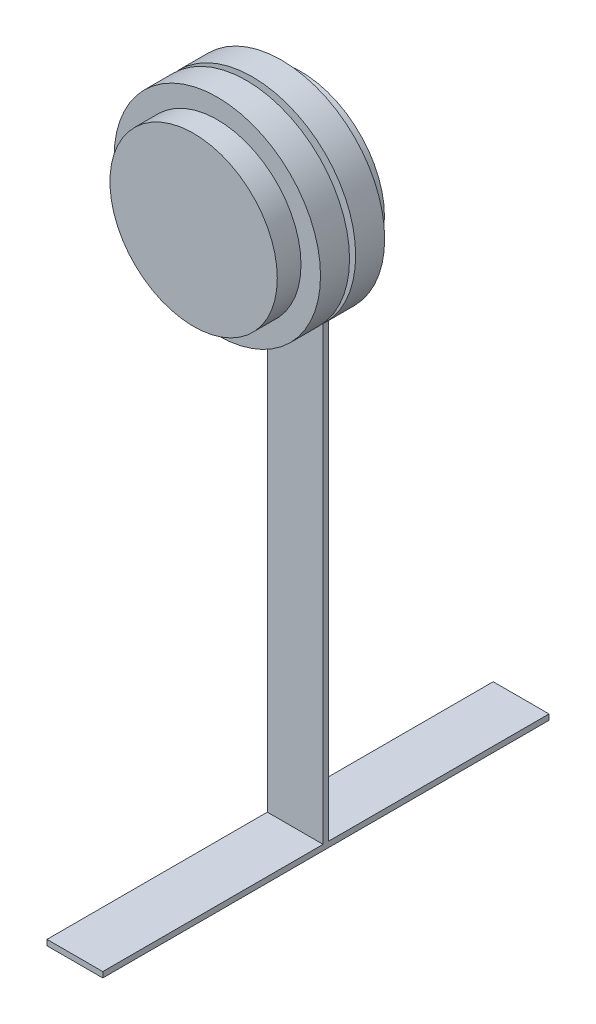
ISO-10303-21;
HEADER;
FILE_DESCRIPTION(('STEP AP214'),'2;1');
FILE_NAME('part.step','',(''),(''),'','','');
FILE_SCHEMA(('AUTOMOTIVE_DESIGN { 1 0 10303 214 1 1 1 1 }'));
ENDSEC;
DATA;
#1=APPLICATION_CONTEXT('core data for automotive mechanical design processes');
#2=APPLICATION_PROTOCOL_DEFINITION('international standard','automotive_design',2000,#1);
#3=PRODUCT_CONTEXT('',#1,'mechanical');
#4=PRODUCT('Part','Part','',(#3));
#5=PRODUCT_RELATED_PRODUCT_CATEGORY('part','',(#4));
#6=PRODUCT_DEFINITION_FORMATION('','',#4);
#7=PRODUCT_DEFINITION_CONTEXT('part definition',#1,'design');
#8=PRODUCT_DEFINITION('design','',#6,#7);
#9=PRODUCT_DEFINITION_SHAPE('','',#8);
#10=(LENGTH_UNIT() NAMED_UNIT(*) SI_UNIT(.MILLI.,.METRE.));
#11=(NAMED_UNIT(*) PLANE_ANGLE_UNIT() SI_UNIT($,.RADIAN.));
#12=(NAMED_UNIT(*) SI_UNIT($,.STERADIAN.) SOLID_ANGLE_UNIT());
#13=UNCERTAINTY_MEASURE_WITH_UNIT(LENGTH_MEASURE(1.E-05),#10,'distance_accuracy_value','');
#14=(GEOMETRIC_REPRESENTATION_CONTEXT(3) GLOBAL_UNCERTAINTY_ASSIGNED_CONTEXT((#13)) GLOBAL_UNIT_ASSIGNED_CONTEXT((#10,
#11,#12)) REPRESENTATION_CONTEXT('',''));
#15=CARTESIAN_POINT('',(0.,0.,0.));
#16=DIRECTION('',(0.,0.,1.));
#17=DIRECTION('',(1.,0.,0.));
#18=AXIS2_PLACEMENT_3D('',#15,#16,#17);
#19=CARTESIAN_POINT('',(0.,0.,-23.4));
#20=DIRECTION('',(0.,0.,1.));
#21=DIRECTION('',(1.,0.,0.));
#22=AXIS2_PLACEMENT_3D('',#19,#20,#21);
#23=PLANE('',#22);
#24=DIRECTION('',(1.,0.,0.));
#25=VECTOR('',#24,1.);
#26=CARTESIAN_POINT('',(0.,-259.08,-23.4));
#27=LINE('',#26,#25);
#28=CARTESIAN_POINT('',(-12.7,-259.08,-23.4));
#29=VERTEX_POINT('',#28);
#30=CARTESIAN_POINT('',(12.7,-259.08,-23.4));
#31=VERTEX_POINT('',#30);
#32=EDGE_CURVE('E50',#29,#31,#27,.T.);
#33=ORIENTED_EDGE('',*,*,#32,.F.);
#34=DIRECTION('',(0.,1.,0.));
#35=VECTOR('',#34,1.);
#36=CARTESIAN_POINT('',(-12.7,-261.62,-23.4));
#37=LINE('',#36,#35);
#38=CARTESIAN_POINT('',(-12.7,-35.9210244842766,-23.4));
#39=VERTEX_POINT('',#38);
#40=EDGE_CURVE('E104',#29,#39,#37,.T.);
#41=ORIENTED_EDGE('',*,*,#40,.T.);
#42=CARTESIAN_POINT('',(0.,0.,-23.4));
#43=DIRECTION('',(0.,0.,1.));
#44=DIRECTION('',(1.,0.,0.));
#45=AXIS2_PLACEMENT_3D('',#42,#43,#44);
#46=CIRCLE('',#45,38.1);
#47=CARTESIAN_POINT('',(12.7,-35.9210244842766,-23.4));
#48=VERTEX_POINT('',#47);
#49=EDGE_CURVE('E176',#48,#39,#46,.T.);
#50=ORIENTED_EDGE('',*,*,#49,.F.);
#51=DIRECTION('',(0.,-1.,0.));
#52=VECTOR('',#51,1.);
#53=CARTESIAN_POINT('',(12.7,-35.9210244842766,-23.4));
#54=LINE('',#53,#52);
#55=EDGE_CURVE('E55',#48,#31,#54,.T.);
#56=ORIENTED_EDGE('',*,*,#55,.T.);
#57=EDGE_LOOP('',(#33,#41,#50,#56));
#58=FACE_BOUND('',#57,.T.);
#59=ADVANCED_FACE('F35',(#58),#23,.F.);
#60=CARTESIAN_POINT('',(0.,0.,-20.86));
#61=DIRECTION('',(0.,0.,-1.));
#62=DIRECTION('',(-1.,0.,0.));
#63=AXIS2_PLACEMENT_3D('',#60,#61,#62);
#64=PLANE('',#63);
#65=DIRECTION('',(-1.,0.,0.));
#66=VECTOR('',#65,1.);
#67=CARTESIAN_POINT('',(0.,-259.08,-20.86));
#68=LINE('',#67,#66);
#69=CARTESIAN_POINT('',(12.7,-259.08,-20.86));
#70=VERTEX_POINT('',#69);
#71=CARTESIAN_POINT('',(-12.7,-259.08,-20.86));
#72=VERTEX_POINT('',#71);
#73=EDGE_CURVE('E11',#70,#72,#68,.T.);
#74=ORIENTED_EDGE('',*,*,#73,.F.);
#75=DIRECTION('',(0.,-1.,0.));
#76=VECTOR('',#75,1.);
#77=CARTESIAN_POINT('',(12.7,-35.9210244842766,-20.86));
#78=LINE('',#77,#76);
#79=CARTESIAN_POINT('',(12.7,-35.9210244842766,-20.86));
#80=VERTEX_POINT('',#79);
#81=EDGE_CURVE('E143',#80,#70,#78,.T.);
#82=ORIENTED_EDGE('',*,*,#81,.F.);
#83=CARTESIAN_POINT('',(0.,0.,-20.86));
#84=DIRECTION('',(0.,0.,1.));
#85=DIRECTION('',(-1.,0.,0.));
#86=AXIS2_PLACEMENT_3D('',#83,#84,#85);
#87=CIRCLE('',#86,38.1);
#88=CARTESIAN_POINT('',(-12.7,-35.9210244842766,-20.86));
#89=VERTEX_POINT('',#88);
#90=EDGE_CURVE('E141',#89,#80,#87,.T.);
#91=ORIENTED_EDGE('',*,*,#90,.F.);
#92=DIRECTION('',(0.,1.,0.));
#93=VECTOR('',#92,1.);
#94=CARTESIAN_POINT('',(-12.7,-261.62,-20.86));
#95=LINE('',#94,#93);
#96=EDGE_CURVE('E146',#72,#89,#95,.T.);
#97=ORIENTED_EDGE('',*,*,#96,.F.);
#98=EDGE_LOOP('',(#74,#82,#91,#97));
#99=FACE_BOUND('',#98,.T.);
#100=ADVANCED_FACE('F212',(#99),#64,.F.);
#101=CARTESIAN_POINT('',(0.,0.,-23.4));
#102=DIRECTION('',(0.,0.,1.));
#103=DIRECTION('',(1.,0.,0.));
#104=AXIS2_PLACEMENT_3D('',#101,#102,#103);
#105=CYLINDRICAL_SURFACE('',#104,38.1);
#106=CARTESIAN_POINT('',(0.,0.,14.605));
#107=DIRECTION('',(0.,0.,1.));
#108=DIRECTION('',(1.,0.,0.));
#109=AXIS2_PLACEMENT_3D('',#106,#107,#108);
#110=CIRCLE('',#109,38.1);
#111=CARTESIAN_POINT('',(38.1,0.,14.605));
#112=VERTEX_POINT('',#111);
#113=EDGE_CURVE('E179',#112,#112,#110,.F.);
#114=ORIENTED_EDGE('',*,*,#113,.F.);
#115=EDGE_LOOP('',(#114));
#116=FACE_BOUND('',#115,.T.);
#117=CARTESIAN_POINT('',(0.,0.,25.4));
#118=DIRECTION('',(0.,0.,1.));
#119=DIRECTION('',(1.,0.,0.));
#120=AXIS2_PLACEMENT_3D('',#117,#118,#119);
#121=CIRCLE('',#120,38.1);
#122=CARTESIAN_POINT('',(38.1,0.,25.4));
#123=VERTEX_POINT('',#122);
#124=EDGE_CURVE('E173',#123,#123,#121,.T.);
#125=ORIENTED_EDGE('',*,*,#124,.F.);
#126=EDGE_LOOP('',(#125));
#127=FACE_BOUND('',#126,.T.);
#128=ADVANCED_FACE('F37',(#116,#127),#105,.T.);
#129=CARTESIAN_POINT('',(0.,0.,25.4));
#130=DIRECTION('',(0.,0.,1.));
#131=DIRECTION('',(1.,0.,0.));
#132=AXIS2_PLACEMENT_3D('',#129,#130,#131);
#133=PLANE('',#132);
#134=ORIENTED_EDGE('',*,*,#124,.T.);
#135=EDGE_LOOP('',(#134));
#136=FACE_BOUND('',#135,.T.);
#137=ADVANCED_FACE('F219',(#136),#133,.T.);
#138=CARTESIAN_POINT('',(0.,0.,14.605));
#139=DIRECTION('',(0.,0.,-1.));
#140=DIRECTION('',(-1.,0.,0.));
#141=AXIS2_PLACEMENT_3D('',#138,#139,#140);
#142=CYLINDRICAL_SURFACE('',#141,46.99);
#143=CARTESIAN_POINT('',(0.,0.,14.605));
#144=DIRECTION('',(0.,0.,1.));
#145=DIRECTION('',(1.,0.,0.));
#146=AXIS2_PLACEMENT_3D('',#143,#144,#145);
#147=CIRCLE('',#146,46.99);
#148=CARTESIAN_POINT('',(46.99,0.,14.605));
#149=VERTEX_POINT('',#148);
#150=EDGE_CURVE('E166',#149,#149,#147,.T.);
#151=ORIENTED_EDGE('',*,*,#150,.F.);
#152=EDGE_LOOP('',(#151));
#153=FACE_BOUND('',#152,.T.);
#154=CARTESIAN_POINT('',(0.,0.,1.397));
#155=DIRECTION('',(0.,0.,1.));
#156=DIRECTION('',(1.,0.,0.));
#157=AXIS2_PLACEMENT_3D('',#154,#155,#156);
#158=CIRCLE('',#157,46.99);
#159=CARTESIAN_POINT('',(46.99,0.,1.397));
#160=VERTEX_POINT('',#159);
#161=EDGE_CURVE('E170',#160,#160,#158,.T.);
#162=ORIENTED_EDGE('',*,*,#161,.T.);
#163=EDGE_LOOP('',(#162));
#164=FACE_BOUND('',#163,.T.);
#165=ADVANCED_FACE('F222',(#153,#164),#142,.T.);
#166=CARTESIAN_POINT('',(0.,0.,14.605));
#167=DIRECTION('',(0.,0.,1.));
#168=DIRECTION('',(1.,0.,0.));
#169=AXIS2_PLACEMENT_3D('',#166,#167,#168);
#170=PLANE('',#169);
#171=ORIENTED_EDGE('',*,*,#113,.T.);
#172=EDGE_LOOP('',(#171));
#173=FACE_BOUND('',#172,.T.);
#174=ORIENTED_EDGE('',*,*,#150,.T.);
#175=EDGE_LOOP('',(#174));
#176=FACE_BOUND('',#175,.T.);
#177=ADVANCED_FACE('F226',(#173,#176),#170,.T.);
#178=CARTESIAN_POINT('',(0.,0.,1.397));
#179=DIRECTION('',(0.,0.,1.));
#180=DIRECTION('',(1.,0.,0.));
#181=AXIS2_PLACEMENT_3D('',#178,#179,#180);
#182=PLANE('',#181);
#183=CARTESIAN_POINT('',(0.,0.,1.397));
#184=DIRECTION('',(0.,0.,1.));
#185=DIRECTION('',(1.,0.,0.));
#186=AXIS2_PLACEMENT_3D('',#183,#184,#185);
#187=CIRCLE('',#186,38.1);
#188=CARTESIAN_POINT('',(38.1,0.,1.397));
#189=VERTEX_POINT('',#188);
#190=EDGE_CURVE('E169',#189,#189,#187,.F.);
#191=ORIENTED_EDGE('',*,*,#190,.F.);
#192=EDGE_LOOP('',(#191));
#193=FACE_BOUND('',#192,.T.);
#194=ORIENTED_EDGE('',*,*,#161,.F.);
#195=EDGE_LOOP('',(#194));
#196=FACE_BOUND('',#195,.T.);
#197=ADVANCED_FACE('F228',(#193,#196),#182,.F.);
#198=CARTESIAN_POINT('',(0.,0.,-1.397));
#199=DIRECTION('',(0.,0.,1.));
#200=DIRECTION('',(1.,0.,0.));
#201=AXIS2_PLACEMENT_3D('',#198,#199,#200);
#202=CIRCLE('',#201,38.1);
#203=CARTESIAN_POINT('',(38.1,0.,-1.397));
#204=VERTEX_POINT('',#203);
#205=EDGE_CURVE('E43',#204,#204,#202,.F.);
#206=ORIENTED_EDGE('',*,*,#205,.F.);
#207=EDGE_LOOP('',(#206));
#208=FACE_BOUND('',#207,.T.);
#209=ORIENTED_EDGE('',*,*,#190,.T.);
#210=EDGE_LOOP('',(#209));
#211=FACE_BOUND('',#210,.T.);
#212=ADVANCED_FACE('F200',(#208,#211),#105,.T.);
#213=CARTESIAN_POINT('',(0.,0.,-14.605));
#214=DIRECTION('',(0.,0.,1.));
#215=DIRECTION('',(1.,0.,0.));
#216=AXIS2_PLACEMENT_3D('',#213,#214,#215);
#217=CYLINDRICAL_SURFACE('',#216,46.99);
#218=CARTESIAN_POINT('',(0.,0.,-14.605));
#219=DIRECTION('',(0.,0.,1.));
#220=DIRECTION('',(1.,0.,0.));
#221=AXIS2_PLACEMENT_3D('',#218,#219,#220);
#222=CIRCLE('',#221,46.99);
#223=CARTESIAN_POINT('',(46.99,0.,-14.605));
#224=VERTEX_POINT('',#223);
#225=EDGE_CURVE('E160',#224,#224,#222,.T.);
#226=ORIENTED_EDGE('',*,*,#225,.T.);
#227=EDGE_LOOP('',(#226));
#228=FACE_BOUND('',#227,.T.);
#229=CARTESIAN_POINT('',(0.,0.,-1.397));
#230=DIRECTION('',(0.,0.,1.));
#231=DIRECTION('',(1.,0.,0.));
#232=AXIS2_PLACEMENT_3D('',#229,#230,#231);
#233=CIRCLE('',#232,46.99);
#234=CARTESIAN_POINT('',(46.99,0.,-1.397));
#235=VERTEX_POINT('',#234);
#236=EDGE_CURVE('E153',#235,#235,#233,.T.);
#237=ORIENTED_EDGE('',*,*,#236,.F.);
#238=EDGE_LOOP('',(#237));
#239=FACE_BOUND('',#238,.T.);
#240=ADVANCED_FACE('F194',(#228,#239),#217,.T.);
#241=CARTESIAN_POINT('',(0.,0.,-14.605));
#242=DIRECTION('',(0.,0.,1.));
#243=DIRECTION('',(1.,0.,0.));
#244=AXIS2_PLACEMENT_3D('',#241,#242,#243);
#245=PLANE('',#244);
#246=CARTESIAN_POINT('',(0.,0.,-14.605));
#247=DIRECTION('',(0.,0.,1.));
#248=DIRECTION('',(1.,0.,0.));
#249=AXIS2_PLACEMENT_3D('',#246,#247,#248);
#250=CIRCLE('',#249,38.1);
#251=CARTESIAN_POINT('',(38.1,0.,-14.605));
#252=VERTEX_POINT('',#251);
#253=EDGE_CURVE('E163',#252,#252,#250,.F.);
#254=ORIENTED_EDGE('',*,*,#253,.F.);
#255=EDGE_LOOP('',(#254));
#256=FACE_BOUND('',#255,.T.);
#257=ORIENTED_EDGE('',*,*,#225,.F.);
#258=EDGE_LOOP('',(#257));
#259=FACE_BOUND('',#258,.T.);
#260=ADVANCED_FACE('F190',(#256,#259),#245,.F.);
#261=CARTESIAN_POINT('',(0.,0.,-1.397));
#262=DIRECTION('',(0.,0.,1.));
#263=DIRECTION('',(1.,0.,0.));
#264=AXIS2_PLACEMENT_3D('',#261,#262,#263);
#265=PLANE('',#264);
#266=ORIENTED_EDGE('',*,*,#205,.T.);
#267=EDGE_LOOP('',(#266));
#268=FACE_BOUND('',#267,.T.);
#269=ORIENTED_EDGE('',*,*,#236,.T.);
#270=EDGE_LOOP('',(#269));
#271=FACE_BOUND('',#270,.T.);
#272=ADVANCED_FACE('F193',(#268,#271),#265,.T.);
#273=DIRECTION('',(0.,0.,-1.));
#274=VECTOR('',#273,1.);
#275=CARTESIAN_POINT('',(-12.7,-35.9210244842766,-20.86));
#276=LINE('',#275,#274);
#277=EDGE_CURVE('E151',#89,#39,#276,.T.);
#278=ORIENTED_EDGE('',*,*,#277,.F.);
#279=ORIENTED_EDGE('',*,*,#90,.T.);
#280=DIRECTION('',(0.,0.,-1.));
#281=VECTOR('',#280,1.);
#282=CARTESIAN_POINT('',(12.7,-35.9210244842766,-20.86));
#283=LINE('',#282,#281);
#284=EDGE_CURVE('E148',#80,#48,#283,.T.);
#285=ORIENTED_EDGE('',*,*,#284,.T.);
#286=ORIENTED_EDGE('',*,*,#49,.T.);
#287=EDGE_LOOP('',(#278,#279,#285,#286));
#288=FACE_BOUND('',#287,.T.);
#289=ORIENTED_EDGE('',*,*,#253,.T.);
#290=EDGE_LOOP('',(#289));
#291=FACE_BOUND('',#290,.T.);
#292=ADVANCED_FACE('F188',(#288,#291),#105,.T.);
#293=CARTESIAN_POINT('',(-12.7,-261.62,-20.86));
#294=DIRECTION('',(-1.,0.,0.));
#295=DIRECTION('',(0.,-1.,0.));
#296=AXIS2_PLACEMENT_3D('',#293,#294,#295);
#297=PLANE('',#296);
#298=DIRECTION('',(0.,0.,-1.));
#299=VECTOR('',#298,1.);
#300=CARTESIAN_POINT('',(-12.7,-259.08,-123.73));
#301=LINE('',#300,#299);
#302=CARTESIAN_POINT('',(-12.7,-259.08,79.47));
#303=VERTEX_POINT('',#302);
#304=EDGE_CURVE('E107',#303,#72,#301,.T.);
#305=ORIENTED_EDGE('',*,*,#304,.T.);
#306=ORIENTED_EDGE('',*,*,#96,.T.);
#307=ORIENTED_EDGE('',*,*,#277,.T.);
#308=ORIENTED_EDGE('',*,*,#40,.F.);
#309=CARTESIAN_POINT('',(-12.7,-259.08,-123.73));
#310=VERTEX_POINT('',#309);
#311=EDGE_CURVE('E97',#29,#310,#301,.T.);
#312=ORIENTED_EDGE('',*,*,#311,.T.);
#313=DIRECTION('',(0.,-1.,0.));
#314=VECTOR('',#313,1.);
#315=CARTESIAN_POINT('',(-12.7,-259.08,-123.73));
#316=LINE('',#315,#314);
#317=CARTESIAN_POINT('',(-12.7,-261.62,-123.73));
#318=VERTEX_POINT('',#317);
#319=EDGE_CURVE('E101',#310,#318,#316,.T.);
#320=ORIENTED_EDGE('',*,*,#319,.T.);
#321=DIRECTION('',(0.,0.,-1.));
#322=VECTOR('',#321,1.);
#323=CARTESIAN_POINT('',(-12.7,-261.62,-20.86));
#324=LINE('',#323,#322);
#325=CARTESIAN_POINT('',(-12.7,-261.62,79.47));
#326=VERTEX_POINT('',#325);
#327=EDGE_CURVE('E154',#326,#318,#324,.T.);
#328=ORIENTED_EDGE('',*,*,#327,.F.);
#329=DIRECTION('',(0.,-1.,0.));
#330=VECTOR('',#329,1.);
#331=CARTESIAN_POINT('',(-12.7,-259.08,79.47));
#332=LINE('',#331,#330);
#333=EDGE_CURVE('E133',#303,#326,#332,.T.);
#334=ORIENTED_EDGE('',*,*,#333,.F.);
#335=EDGE_LOOP('',(#305,#306,#307,#308,#312,#320,#328,#334));
#336=FACE_BOUND('',#335,.T.);
#337=ADVANCED_FACE('F100',(#336),#297,.T.);
#338=CARTESIAN_POINT('',(12.7,-261.62,-20.86));
#339=DIRECTION('',(0.,-1.,0.));
#340=DIRECTION('',(0.,0.,-1.));
#341=AXIS2_PLACEMENT_3D('',#338,#339,#340);
#342=PLANE('',#341);
#343=ORIENTED_EDGE('',*,*,#327,.T.);
#344=DIRECTION('',(1.,0.,0.));
#345=VECTOR('',#344,1.);
#346=CARTESIAN_POINT('',(12.7,-261.62,-123.73));
#347=LINE('',#346,#345);
#348=CARTESIAN_POINT('',(12.7,-261.62,-123.73));
#349=VERTEX_POINT('',#348);
#350=EDGE_CURVE('E116',#318,#349,#347,.T.);
#351=ORIENTED_EDGE('',*,*,#350,.T.);
#352=DIRECTION('',(0.,0.,-1.));
#353=VECTOR('',#352,1.);
#354=CARTESIAN_POINT('',(12.7,-261.62,-20.86));
#355=LINE('',#354,#353);
#356=CARTESIAN_POINT('',(12.7,-261.62,79.47));
#357=VERTEX_POINT('',#356);
#358=EDGE_CURVE('E156',#357,#349,#355,.T.);
#359=ORIENTED_EDGE('',*,*,#358,.F.);
#360=DIRECTION('',(-1.,0.,0.));
#361=VECTOR('',#360,1.);
#362=CARTESIAN_POINT('',(12.7,-261.62,79.47));
#363=LINE('',#362,#361);
#364=EDGE_CURVE('E108',#357,#326,#363,.T.);
#365=ORIENTED_EDGE('',*,*,#364,.T.);
#366=EDGE_LOOP('',(#343,#351,#359,#365));
#367=FACE_BOUND('',#366,.T.);
#368=ADVANCED_FACE('F298',(#367),#342,.T.);
#369=CARTESIAN_POINT('',(12.7,-35.9210244842766,-20.86));
#370=DIRECTION('',(1.,0.,0.));
#371=DIRECTION('',(0.,1.,0.));
#372=AXIS2_PLACEMENT_3D('',#369,#370,#371);
#373=PLANE('',#372);
#374=ORIENTED_EDGE('',*,*,#358,.T.);
#375=DIRECTION('',(0.,-1.,0.));
#376=VECTOR('',#375,1.);
#377=CARTESIAN_POINT('',(12.7,-259.08,-123.73));
#378=LINE('',#377,#376);
#379=CARTESIAN_POINT('',(12.7,-259.08,-123.73));
#380=VERTEX_POINT('',#379);
#381=EDGE_CURVE('E117',#380,#349,#378,.T.);
#382=ORIENTED_EDGE('',*,*,#381,.F.);
#383=DIRECTION('',(0.,0.,1.));
#384=VECTOR('',#383,1.);
#385=CARTESIAN_POINT('',(12.7,-259.08,-123.73));
#386=LINE('',#385,#384);
#387=EDGE_CURVE('E123',#380,#31,#386,.T.);
#388=ORIENTED_EDGE('',*,*,#387,.T.);
#389=ORIENTED_EDGE('',*,*,#55,.F.);
#390=ORIENTED_EDGE('',*,*,#284,.F.);
#391=ORIENTED_EDGE('',*,*,#81,.T.);
#392=CARTESIAN_POINT('',(12.7,-259.08,79.47));
#393=VERTEX_POINT('',#392);
#394=EDGE_CURVE('E124',#70,#393,#386,.T.);
#395=ORIENTED_EDGE('',*,*,#394,.T.);
#396=DIRECTION('',(0.,-1.,0.));
#397=VECTOR('',#396,1.);
#398=CARTESIAN_POINT('',(12.7,-259.08,79.47));
#399=LINE('',#398,#397);
#400=EDGE_CURVE('E136',#393,#357,#399,.T.);
#401=ORIENTED_EDGE('',*,*,#400,.T.);
#402=EDGE_LOOP('',(#374,#382,#388,#389,#390,#391,#395,#401));
#403=FACE_BOUND('',#402,.T.);
#404=ADVANCED_FACE('F307',(#403),#373,.T.);
#405=CARTESIAN_POINT('',(12.7,-259.08,79.47));
#406=DIRECTION('',(0.,0.,1.));
#407=DIRECTION('',(1.,0.,0.));
#408=AXIS2_PLACEMENT_3D('',#405,#406,#407);
#409=PLANE('',#408);
#410=ORIENTED_EDGE('',*,*,#364,.F.);
#411=ORIENTED_EDGE('',*,*,#400,.F.);
#412=DIRECTION('',(-1.,0.,0.));
#413=VECTOR('',#412,1.);
#414=CARTESIAN_POINT('',(12.7,-259.08,79.47));
#415=LINE('',#414,#413);
#416=EDGE_CURVE('E118',#393,#303,#415,.T.);
#417=ORIENTED_EDGE('',*,*,#416,.T.);
#418=ORIENTED_EDGE('',*,*,#333,.T.);
#419=EDGE_LOOP('',(#410,#411,#417,#418));
#420=FACE_BOUND('',#419,.T.);
#421=ADVANCED_FACE('F318',(#420),#409,.T.);
#422=CARTESIAN_POINT('',(0.,-259.08,0.));
#423=DIRECTION('',(0.,-1.,0.));
#424=DIRECTION('',(0.,0.,-1.));
#425=AXIS2_PLACEMENT_3D('',#422,#423,#424);
#426=PLANE('',#425);
#427=ORIENTED_EDGE('',*,*,#394,.F.);
#428=ORIENTED_EDGE('',*,*,#73,.T.);
#429=ORIENTED_EDGE('',*,*,#304,.F.);
#430=ORIENTED_EDGE('',*,*,#416,.F.);
#431=EDGE_LOOP('',(#427,#428,#429,#430));
#432=FACE_BOUND('',#431,.T.);
#433=ADVANCED_FACE('F328',(#432),#426,.F.);
#434=ORIENTED_EDGE('',*,*,#311,.F.);
#435=ORIENTED_EDGE('',*,*,#32,.T.);
#436=ORIENTED_EDGE('',*,*,#387,.F.);
#437=DIRECTION('',(1.,0.,0.));
#438=VECTOR('',#437,1.);
#439=CARTESIAN_POINT('',(12.7,-259.08,-123.73));
#440=LINE('',#439,#438);
#441=EDGE_CURVE('E114',#310,#380,#440,.T.);
#442=ORIENTED_EDGE('',*,*,#441,.F.);
#443=EDGE_LOOP('',(#434,#435,#436,#442));
#444=FACE_BOUND('',#443,.T.);
#445=ADVANCED_FACE('F121',(#444),#426,.F.);
#446=CARTESIAN_POINT('',(12.7,-259.08,-123.73));
#447=DIRECTION('',(0.,0.,-1.));
#448=DIRECTION('',(-1.,0.,0.));
#449=AXIS2_PLACEMENT_3D('',#446,#447,#448);
#450=PLANE('',#449);
#451=ORIENTED_EDGE('',*,*,#350,.F.);
#452=ORIENTED_EDGE('',*,*,#319,.F.);
#453=ORIENTED_EDGE('',*,*,#441,.T.);
#454=ORIENTED_EDGE('',*,*,#381,.T.);
#455=EDGE_LOOP('',(#451,#452,#453,#454));
#456=FACE_BOUND('',#455,.T.);
#457=ADVANCED_FACE('F112',(#456),#450,.T.);
#458=CLOSED_SHELL('',(#59,#100,#128,#137,#165,#177,#197,#212,#240,#260,#272,#292,#337,#368,#404,
#421,#433,#445,#457));
#459=MANIFOLD_SOLID_BREP('B2',#458);
#460=ADVANCED_BREP_SHAPE_REPRESENTATION('',(#18,#459),#14);
#461=SHAPE_DEFINITION_REPRESENTATION(#9,#460);
ENDSEC;
END-ISO-10303-21;
